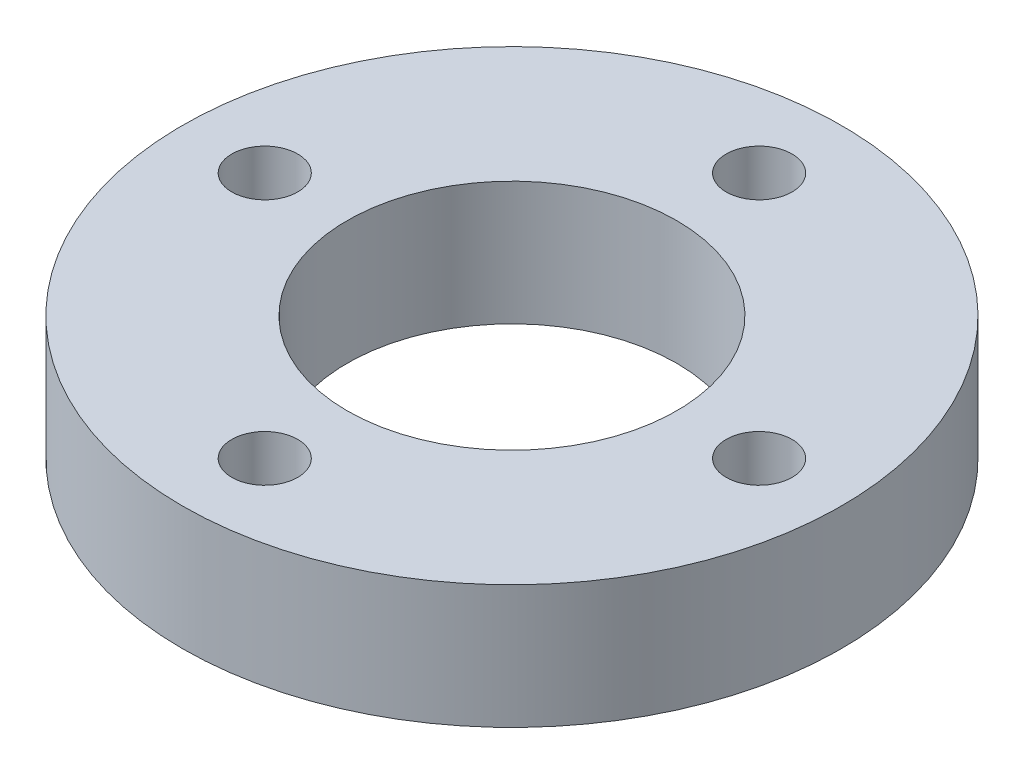
ISO-10303-21;
HEADER;
FILE_DESCRIPTION(('STEP AP214'),'2;1');
FILE_NAME('part.step','',(''),(''),'','','');
FILE_SCHEMA(('AUTOMOTIVE_DESIGN { 1 0 10303 214 1 1 1 1 }'));
ENDSEC;
DATA;
#1=APPLICATION_CONTEXT('core data for automotive mechanical design processes');
#2=APPLICATION_PROTOCOL_DEFINITION('international standard','automotive_design',2000,#1);
#3=PRODUCT_CONTEXT('',#1,'mechanical');
#4=PRODUCT('Part','Part','',(#3));
#5=PRODUCT_RELATED_PRODUCT_CATEGORY('part','',(#4));
#6=PRODUCT_DEFINITION_FORMATION('','',#4);
#7=PRODUCT_DEFINITION_CONTEXT('part definition',#1,'design');
#8=PRODUCT_DEFINITION('design','',#6,#7);
#9=PRODUCT_DEFINITION_SHAPE('','',#8);
#10=(LENGTH_UNIT() NAMED_UNIT(*) SI_UNIT(.MILLI.,.METRE.));
#11=(NAMED_UNIT(*) PLANE_ANGLE_UNIT() SI_UNIT($,.RADIAN.));
#12=(NAMED_UNIT(*) SI_UNIT($,.STERADIAN.) SOLID_ANGLE_UNIT());
#13=UNCERTAINTY_MEASURE_WITH_UNIT(LENGTH_MEASURE(1.E-05),#10,'distance_accuracy_value','');
#14=(GEOMETRIC_REPRESENTATION_CONTEXT(3) GLOBAL_UNCERTAINTY_ASSIGNED_CONTEXT((#13)) GLOBAL_UNIT_ASSIGNED_CONTEXT((#10,
#11,#12)) REPRESENTATION_CONTEXT('',''));
#15=CARTESIAN_POINT('',(0.,0.,0.));
#16=DIRECTION('',(0.,0.,1.));
#17=DIRECTION('',(1.,0.,0.));
#18=AXIS2_PLACEMENT_3D('',#15,#16,#17);
#19=CARTESIAN_POINT('',(0.,6.,0.));
#20=DIRECTION('',(0.,1.,0.));
#21=DIRECTION('',(0.,0.,1.));
#22=AXIS2_PLACEMENT_3D('',#19,#20,#21);
#23=PLANE('',#22);
#24=CARTESIAN_POINT('',(12.,6.,0.));
#25=DIRECTION('',(0.,1.,0.));
#26=DIRECTION('',(0.,0.,1.));
#27=AXIS2_PLACEMENT_3D('',#24,#25,#26);
#28=CIRCLE('',#27,1.6);
#29=CARTESIAN_POINT('',(12.,6.,1.60000000000009));
#30=VERTEX_POINT('',#29);
#31=EDGE_CURVE('E61',#30,#30,#28,.T.);
#32=ORIENTED_EDGE('',*,*,#31,.F.);
#33=EDGE_LOOP('',(#32));
#34=FACE_BOUND('',#33,.T.);
#35=CARTESIAN_POINT('',(-12.,6.,0.));
#36=DIRECTION('',(0.,1.,0.));
#37=DIRECTION('',(0.,0.,1.));
#38=AXIS2_PLACEMENT_3D('',#35,#36,#37);
#39=CIRCLE('',#38,1.6);
#40=CARTESIAN_POINT('',(-12.,6.,1.6));
#41=VERTEX_POINT('',#40);
#42=EDGE_CURVE('E49',#41,#41,#39,.T.);
#43=ORIENTED_EDGE('',*,*,#42,.F.);
#44=EDGE_LOOP('',(#43));
#45=FACE_BOUND('',#44,.T.);
#46=CARTESIAN_POINT('',(0.,6.,0.));
#47=DIRECTION('',(0.,1.,0.));
#48=DIRECTION('',(0.,0.,1.));
#49=AXIS2_PLACEMENT_3D('',#46,#47,#48);
#50=CIRCLE('',#49,16.);
#51=CARTESIAN_POINT('',(0.,6.,16.));
#52=VERTEX_POINT('',#51);
#53=EDGE_CURVE('E10',#52,#52,#50,.T.);
#54=ORIENTED_EDGE('',*,*,#53,.T.);
#55=EDGE_LOOP('',(#54));
#56=FACE_BOUND('',#55,.T.);
#57=CARTESIAN_POINT('',(0.,6.,0.));
#58=DIRECTION('',(0.,1.,0.));
#59=DIRECTION('',(0.,0.,1.));
#60=AXIS2_PLACEMENT_3D('',#57,#58,#59);
#61=CIRCLE('',#60,8.);
#62=CARTESIAN_POINT('',(0.,6.,8.));
#63=VERTEX_POINT('',#62);
#64=EDGE_CURVE('E44',#63,#63,#61,.T.);
#65=ORIENTED_EDGE('',*,*,#64,.F.);
#66=EDGE_LOOP('',(#65));
#67=FACE_BOUND('',#66,.T.);
#68=CARTESIAN_POINT('',(0.,6.,-12.));
#69=DIRECTION('',(0.,1.,0.));
#70=DIRECTION('',(0.,0.,1.));
#71=AXIS2_PLACEMENT_3D('',#68,#69,#70);
#72=CIRCLE('',#71,1.6);
#73=CARTESIAN_POINT('',(0.,6.,-10.4));
#74=VERTEX_POINT('',#73);
#75=EDGE_CURVE('E55',#74,#74,#72,.T.);
#76=ORIENTED_EDGE('',*,*,#75,.F.);
#77=EDGE_LOOP('',(#76));
#78=FACE_BOUND('',#77,.T.);
#79=CARTESIAN_POINT('',(-1.25693328198353E-13,6.,12.));
#80=DIRECTION('',(0.,1.,0.));
#81=DIRECTION('',(0.,0.,1.));
#82=AXIS2_PLACEMENT_3D('',#79,#80,#81);
#83=CIRCLE('',#82,1.6);
#84=CARTESIAN_POINT('',(-1.25693328198353E-13,6.,13.6));
#85=VERTEX_POINT('',#84);
#86=EDGE_CURVE('E67',#85,#85,#83,.T.);
#87=ORIENTED_EDGE('',*,*,#86,.F.);
#88=EDGE_LOOP('',(#87));
#89=FACE_BOUND('',#88,.T.);
#90=ADVANCED_FACE('F33',(#34,#45,#56,#67,#78,#89),#23,.T.);
#91=CARTESIAN_POINT('',(0.,0.,0.));
#92=DIRECTION('',(0.,1.,0.));
#93=DIRECTION('',(0.,0.,1.));
#94=AXIS2_PLACEMENT_3D('',#91,#92,#93);
#95=PLANE('',#94);
#96=CARTESIAN_POINT('',(0.,0.,0.));
#97=DIRECTION('',(0.,1.,0.));
#98=DIRECTION('',(0.,0.,1.));
#99=AXIS2_PLACEMENT_3D('',#96,#97,#98);
#100=CIRCLE('',#99,16.);
#101=CARTESIAN_POINT('',(0.,0.,16.));
#102=VERTEX_POINT('',#101);
#103=EDGE_CURVE('E37',#102,#102,#100,.T.);
#104=ORIENTED_EDGE('',*,*,#103,.F.);
#105=EDGE_LOOP('',(#104));
#106=FACE_BOUND('',#105,.T.);
#107=CARTESIAN_POINT('',(0.,0.,0.));
#108=DIRECTION('',(0.,1.,0.));
#109=DIRECTION('',(0.,0.,1.));
#110=AXIS2_PLACEMENT_3D('',#107,#108,#109);
#111=CIRCLE('',#110,8.);
#112=CARTESIAN_POINT('',(0.,0.,8.));
#113=VERTEX_POINT('',#112);
#114=EDGE_CURVE('E46',#113,#113,#111,.T.);
#115=ORIENTED_EDGE('',*,*,#114,.T.);
#116=EDGE_LOOP('',(#115));
#117=FACE_BOUND('',#116,.T.);
#118=CARTESIAN_POINT('',(-12.,0.,0.));
#119=DIRECTION('',(0.,1.,0.));
#120=DIRECTION('',(0.,0.,1.));
#121=AXIS2_PLACEMENT_3D('',#118,#119,#120);
#122=CIRCLE('',#121,1.6);
#123=CARTESIAN_POINT('',(-12.,0.,1.6));
#124=VERTEX_POINT('',#123);
#125=EDGE_CURVE('E52',#124,#124,#122,.T.);
#126=ORIENTED_EDGE('',*,*,#125,.T.);
#127=EDGE_LOOP('',(#126));
#128=FACE_BOUND('',#127,.T.);
#129=CARTESIAN_POINT('',(0.,0.,-12.));
#130=DIRECTION('',(0.,1.,0.));
#131=DIRECTION('',(0.,0.,1.));
#132=AXIS2_PLACEMENT_3D('',#129,#130,#131);
#133=CIRCLE('',#132,1.6);
#134=CARTESIAN_POINT('',(0.,0.,-10.4));
#135=VERTEX_POINT('',#134);
#136=EDGE_CURVE('E58',#135,#135,#133,.T.);
#137=ORIENTED_EDGE('',*,*,#136,.T.);
#138=EDGE_LOOP('',(#137));
#139=FACE_BOUND('',#138,.T.);
#140=CARTESIAN_POINT('',(12.,0.,0.));
#141=DIRECTION('',(0.,1.,0.));
#142=DIRECTION('',(0.,0.,1.));
#143=AXIS2_PLACEMENT_3D('',#140,#141,#142);
#144=CIRCLE('',#143,1.6);
#145=CARTESIAN_POINT('',(12.,0.,1.60000000000009));
#146=VERTEX_POINT('',#145);
#147=EDGE_CURVE('E64',#146,#146,#144,.T.);
#148=ORIENTED_EDGE('',*,*,#147,.T.);
#149=EDGE_LOOP('',(#148));
#150=FACE_BOUND('',#149,.T.);
#151=CARTESIAN_POINT('',(-1.25693328198353E-13,0.,12.));
#152=DIRECTION('',(0.,1.,0.));
#153=DIRECTION('',(0.,0.,1.));
#154=AXIS2_PLACEMENT_3D('',#151,#152,#153);
#155=CIRCLE('',#154,1.6);
#156=CARTESIAN_POINT('',(-1.25693328198353E-13,0.,13.6));
#157=VERTEX_POINT('',#156);
#158=EDGE_CURVE('E70',#157,#157,#155,.T.);
#159=ORIENTED_EDGE('',*,*,#158,.T.);
#160=EDGE_LOOP('',(#159));
#161=FACE_BOUND('',#160,.T.);
#162=ADVANCED_FACE('F80',(#106,#117,#128,#139,#150,#161),#95,.F.);
#163=CARTESIAN_POINT('',(0.,6.,0.));
#164=DIRECTION('',(0.,-1.,0.));
#165=DIRECTION('',(0.,0.,-1.));
#166=AXIS2_PLACEMENT_3D('',#163,#164,#165);
#167=CYLINDRICAL_SURFACE('',#166,16.);
#168=ORIENTED_EDGE('',*,*,#53,.F.);
#169=EDGE_LOOP('',(#168));
#170=FACE_BOUND('',#169,.T.);
#171=ORIENTED_EDGE('',*,*,#103,.T.);
#172=EDGE_LOOP('',(#171));
#173=FACE_BOUND('',#172,.T.);
#174=ADVANCED_FACE('F35',(#170,#173),#167,.T.);
#175=CARTESIAN_POINT('',(0.,6.,0.));
#176=DIRECTION('',(0.,-1.,0.));
#177=DIRECTION('',(0.,0.,-1.));
#178=AXIS2_PLACEMENT_3D('',#175,#176,#177);
#179=CYLINDRICAL_SURFACE('',#178,8.);
#180=ORIENTED_EDGE('',*,*,#64,.T.);
#181=EDGE_LOOP('',(#180));
#182=FACE_BOUND('',#181,.T.);
#183=ORIENTED_EDGE('',*,*,#114,.F.);
#184=EDGE_LOOP('',(#183));
#185=FACE_BOUND('',#184,.T.);
#186=ADVANCED_FACE('F90',(#182,#185),#179,.F.);
#187=CARTESIAN_POINT('',(-12.,6.,0.));
#188=DIRECTION('',(0.,-1.,0.));
#189=DIRECTION('',(0.,0.,-1.));
#190=AXIS2_PLACEMENT_3D('',#187,#188,#189);
#191=CYLINDRICAL_SURFACE('',#190,1.6);
#192=ORIENTED_EDGE('',*,*,#42,.T.);
#193=EDGE_LOOP('',(#192));
#194=FACE_BOUND('',#193,.T.);
#195=ORIENTED_EDGE('',*,*,#125,.F.);
#196=EDGE_LOOP('',(#195));
#197=FACE_BOUND('',#196,.T.);
#198=ADVANCED_FACE('F93',(#194,#197),#191,.F.);
#199=CARTESIAN_POINT('',(0.,6.,-12.));
#200=DIRECTION('',(0.,-1.,0.));
#201=DIRECTION('',(0.,0.,-1.));
#202=AXIS2_PLACEMENT_3D('',#199,#200,#201);
#203=CYLINDRICAL_SURFACE('',#202,1.6);
#204=ORIENTED_EDGE('',*,*,#75,.T.);
#205=EDGE_LOOP('',(#204));
#206=FACE_BOUND('',#205,.T.);
#207=ORIENTED_EDGE('',*,*,#136,.F.);
#208=EDGE_LOOP('',(#207));
#209=FACE_BOUND('',#208,.T.);
#210=ADVANCED_FACE('F97',(#206,#209),#203,.F.);
#211=CARTESIAN_POINT('',(12.,6.,0.));
#212=DIRECTION('',(0.,-1.,0.));
#213=DIRECTION('',(0.,0.,-1.));
#214=AXIS2_PLACEMENT_3D('',#211,#212,#213);
#215=CYLINDRICAL_SURFACE('',#214,1.6);
#216=ORIENTED_EDGE('',*,*,#31,.T.);
#217=EDGE_LOOP('',(#216));
#218=FACE_BOUND('',#217,.T.);
#219=ORIENTED_EDGE('',*,*,#147,.F.);
#220=EDGE_LOOP('',(#219));
#221=FACE_BOUND('',#220,.T.);
#222=ADVANCED_FACE('F101',(#218,#221),#215,.F.);
#223=CARTESIAN_POINT('',(-1.25693328198353E-13,6.,12.));
#224=DIRECTION('',(0.,-1.,0.));
#225=DIRECTION('',(0.,0.,-1.));
#226=AXIS2_PLACEMENT_3D('',#223,#224,#225);
#227=CYLINDRICAL_SURFACE('',#226,1.6);
#228=ORIENTED_EDGE('',*,*,#86,.T.);
#229=EDGE_LOOP('',(#228));
#230=FACE_BOUND('',#229,.T.);
#231=ORIENTED_EDGE('',*,*,#158,.F.);
#232=EDGE_LOOP('',(#231));
#233=FACE_BOUND('',#232,.T.);
#234=ADVANCED_FACE('F76',(#230,#233),#227,.F.);
#235=CLOSED_SHELL('',(#90,#162,#174,#186,#198,#210,#222,#234));
#236=MANIFOLD_SOLID_BREP('B2',#235);
#237=ADVANCED_BREP_SHAPE_REPRESENTATION('',(#18,#236),#14);
#238=SHAPE_DEFINITION_REPRESENTATION(#9,#237);
ENDSEC;
END-ISO-10303-21;
